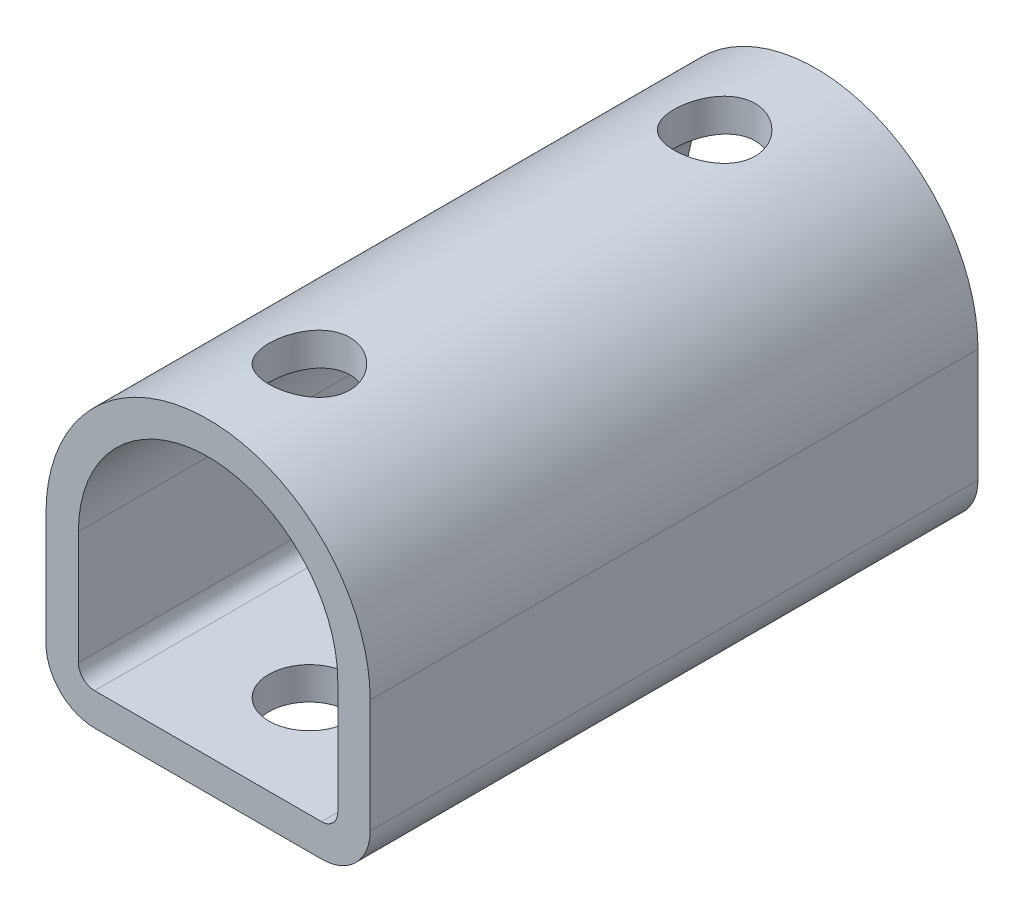
ISO-10303-21;
HEADER;
FILE_DESCRIPTION(('STEP AP214'),'2;1');
FILE_NAME('part.step','',(''),(''),'','','');
FILE_SCHEMA(('AUTOMOTIVE_DESIGN { 1 0 10303 214 1 1 1 1 }'));
ENDSEC;
DATA;
#1=APPLICATION_CONTEXT('core data for automotive mechanical design processes');
#2=APPLICATION_PROTOCOL_DEFINITION('international standard','automotive_design',2000,#1);
#3=PRODUCT_CONTEXT('',#1,'mechanical');
#4=PRODUCT('Part','Part','',(#3));
#5=PRODUCT_RELATED_PRODUCT_CATEGORY('part','',(#4));
#6=PRODUCT_DEFINITION_FORMATION('','',#4);
#7=PRODUCT_DEFINITION_CONTEXT('part definition',#1,'design');
#8=PRODUCT_DEFINITION('design','',#6,#7);
#9=PRODUCT_DEFINITION_SHAPE('','',#8);
#10=(LENGTH_UNIT() NAMED_UNIT(*) SI_UNIT(.MILLI.,.METRE.));
#11=(NAMED_UNIT(*) PLANE_ANGLE_UNIT() SI_UNIT($,.RADIAN.));
#12=(NAMED_UNIT(*) SI_UNIT($,.STERADIAN.) SOLID_ANGLE_UNIT());
#13=UNCERTAINTY_MEASURE_WITH_UNIT(LENGTH_MEASURE(1.E-05),#10,'distance_accuracy_value','');
#14=(GEOMETRIC_REPRESENTATION_CONTEXT(3) GLOBAL_UNCERTAINTY_ASSIGNED_CONTEXT((#13)) GLOBAL_UNIT_ASSIGNED_CONTEXT((#10,
#11,#12)) REPRESENTATION_CONTEXT('',''));
#15=CARTESIAN_POINT('',(0.,0.,0.));
#16=DIRECTION('',(0.,0.,1.));
#17=DIRECTION('',(1.,0.,0.));
#18=AXIS2_PLACEMENT_3D('',#15,#16,#17);
#19=CARTESIAN_POINT('',(14.,-14.,37.5));
#20=DIRECTION('',(0.,0.,1.));
#21=DIRECTION('',(1.,0.,0.));
#22=AXIS2_PLACEMENT_3D('',#19,#20,#21);
#23=PLANE('',#22);
#24=CARTESIAN_POINT('',(14.,-14.,37.5));
#25=DIRECTION('',(0.,0.,1.));
#26=DIRECTION('',(1.,0.,0.));
#27=AXIS2_PLACEMENT_3D('',#24,#25,#26);
#28=CIRCLE('',#27,6.);
#29=CARTESIAN_POINT('',(14.,-20.,37.5));
#30=VERTEX_POINT('',#29);
#31=CARTESIAN_POINT('',(20.,-14.,37.5));
#32=VERTEX_POINT('',#31);
#33=EDGE_CURVE('E181',#30,#32,#28,.T.);
#34=ORIENTED_EDGE('',*,*,#33,.T.);
#35=DIRECTION('',(0.,1.,0.));
#36=VECTOR('',#35,1.);
#37=CARTESIAN_POINT('',(20.,-14.,37.5));
#38=LINE('',#37,#36);
#39=CARTESIAN_POINT('',(20.,0.,37.5));
#40=VERTEX_POINT('',#39);
#41=EDGE_CURVE('E184',#32,#40,#38,.T.);
#42=ORIENTED_EDGE('',*,*,#41,.T.);
#43=CARTESIAN_POINT('',(0.,0.,37.5));
#44=DIRECTION('',(0.,0.,1.));
#45=DIRECTION('',(1.,0.,0.));
#46=AXIS2_PLACEMENT_3D('',#43,#44,#45);
#47=CIRCLE('',#46,20.);
#48=CARTESIAN_POINT('',(-20.,0.,37.5));
#49=VERTEX_POINT('',#48);
#50=EDGE_CURVE('E187',#40,#49,#47,.T.);
#51=ORIENTED_EDGE('',*,*,#50,.T.);
#52=DIRECTION('',(0.,-1.,0.));
#53=VECTOR('',#52,1.);
#54=CARTESIAN_POINT('',(-20.,0.,37.5));
#55=LINE('',#54,#53);
#56=CARTESIAN_POINT('',(-20.,-14.,37.5));
#57=VERTEX_POINT('',#56);
#58=EDGE_CURVE('E189',#49,#57,#55,.T.);
#59=ORIENTED_EDGE('',*,*,#58,.T.);
#60=CARTESIAN_POINT('',(-14.,-14.,37.5));
#61=DIRECTION('',(0.,0.,1.));
#62=DIRECTION('',(1.,0.,0.));
#63=AXIS2_PLACEMENT_3D('',#60,#61,#62);
#64=CIRCLE('',#63,6.);
#65=CARTESIAN_POINT('',(-14.,-20.,37.5));
#66=VERTEX_POINT('',#65);
#67=EDGE_CURVE('E191',#57,#66,#64,.T.);
#68=ORIENTED_EDGE('',*,*,#67,.T.);
#69=DIRECTION('',(1.,0.,0.));
#70=VECTOR('',#69,1.);
#71=CARTESIAN_POINT('',(-14.,-20.,37.5));
#72=LINE('',#71,#70);
#73=EDGE_CURVE('E193',#66,#30,#72,.T.);
#74=ORIENTED_EDGE('',*,*,#73,.T.);
#75=EDGE_LOOP('',(#34,#42,#51,#59,#68,#74));
#76=FACE_BOUND('',#75,.T.);
#77=DIRECTION('',(0.,-1.,0.));
#78=VECTOR('',#77,1.);
#79=CARTESIAN_POINT('',(-16.,0.,37.5));
#80=LINE('',#79,#78);
#81=CARTESIAN_POINT('',(-16.,0.,37.5));
#82=VERTEX_POINT('',#81);
#83=CARTESIAN_POINT('',(-16.,-14.,37.5));
#84=VERTEX_POINT('',#83);
#85=EDGE_CURVE('E136',#82,#84,#80,.T.);
#86=ORIENTED_EDGE('',*,*,#85,.F.);
#87=CARTESIAN_POINT('',(0.,0.,37.5));
#88=DIRECTION('',(0.,0.,1.));
#89=DIRECTION('',(1.,0.,0.));
#90=AXIS2_PLACEMENT_3D('',#87,#88,#89);
#91=CIRCLE('',#90,16.);
#92=CARTESIAN_POINT('',(16.,0.,37.5));
#93=VERTEX_POINT('',#92);
#94=EDGE_CURVE('E128',#93,#82,#91,.T.);
#95=ORIENTED_EDGE('',*,*,#94,.F.);
#96=DIRECTION('',(0.,1.,0.));
#97=VECTOR('',#96,1.);
#98=CARTESIAN_POINT('',(16.,-14.,37.5));
#99=LINE('',#98,#97);
#100=CARTESIAN_POINT('',(16.,-14.,37.5));
#101=VERTEX_POINT('',#100);
#102=EDGE_CURVE('E158',#101,#93,#99,.T.);
#103=ORIENTED_EDGE('',*,*,#102,.F.);
#104=CARTESIAN_POINT('',(14.,-14.,37.5));
#105=DIRECTION('',(0.,0.,1.));
#106=DIRECTION('',(1.,0.,0.));
#107=AXIS2_PLACEMENT_3D('',#104,#105,#106);
#108=CIRCLE('',#107,2.);
#109=CARTESIAN_POINT('',(14.,-16.,37.5));
#110=VERTEX_POINT('',#109);
#111=EDGE_CURVE('E156',#110,#101,#108,.T.);
#112=ORIENTED_EDGE('',*,*,#111,.F.);
#113=DIRECTION('',(1.,0.,0.));
#114=VECTOR('',#113,1.);
#115=CARTESIAN_POINT('',(-14.,-16.,37.5));
#116=LINE('',#115,#114);
#117=CARTESIAN_POINT('',(-14.,-16.,37.5));
#118=VERTEX_POINT('',#117);
#119=EDGE_CURVE('E151',#118,#110,#116,.T.);
#120=ORIENTED_EDGE('',*,*,#119,.F.);
#121=CARTESIAN_POINT('',(-14.,-14.,37.5));
#122=DIRECTION('',(0.,0.,1.));
#123=DIRECTION('',(1.,0.,0.));
#124=AXIS2_PLACEMENT_3D('',#121,#122,#123);
#125=CIRCLE('',#124,2.);
#126=EDGE_CURVE('E149',#84,#118,#125,.T.);
#127=ORIENTED_EDGE('',*,*,#126,.F.);
#128=EDGE_LOOP('',(#86,#95,#103,#112,#120,#127));
#129=FACE_BOUND('',#128,.T.);
#130=ADVANCED_FACE('F32',(#76,#129),#23,.T.);
#131=CARTESIAN_POINT('',(14.,-14.,-37.5));
#132=DIRECTION('',(0.,0.,1.));
#133=DIRECTION('',(1.,0.,0.));
#134=AXIS2_PLACEMENT_3D('',#131,#132,#133);
#135=PLANE('',#134);
#136=CARTESIAN_POINT('',(14.,-14.,-37.5));
#137=DIRECTION('',(0.,0.,1.));
#138=DIRECTION('',(1.,0.,0.));
#139=AXIS2_PLACEMENT_3D('',#136,#137,#138);
#140=CIRCLE('',#139,6.);
#141=CARTESIAN_POINT('',(14.,-20.,-37.5));
#142=VERTEX_POINT('',#141);
#143=CARTESIAN_POINT('',(20.,-14.,-37.5));
#144=VERTEX_POINT('',#143);
#145=EDGE_CURVE('E144',#142,#144,#140,.T.);
#146=ORIENTED_EDGE('',*,*,#145,.F.);
#147=DIRECTION('',(1.,0.,0.));
#148=VECTOR('',#147,1.);
#149=CARTESIAN_POINT('',(-14.,-20.,-37.5));
#150=LINE('',#149,#148);
#151=CARTESIAN_POINT('',(-14.,-20.,-37.5));
#152=VERTEX_POINT('',#151);
#153=EDGE_CURVE('E185',#152,#142,#150,.T.);
#154=ORIENTED_EDGE('',*,*,#153,.F.);
#155=CARTESIAN_POINT('',(-14.,-14.,-37.5));
#156=DIRECTION('',(0.,0.,1.));
#157=DIRECTION('',(1.,0.,0.));
#158=AXIS2_PLACEMENT_3D('',#155,#156,#157);
#159=CIRCLE('',#158,6.);
#160=CARTESIAN_POINT('',(-20.,-14.,-37.5));
#161=VERTEX_POINT('',#160);
#162=EDGE_CURVE('E204',#161,#152,#159,.T.);
#163=ORIENTED_EDGE('',*,*,#162,.F.);
#164=DIRECTION('',(0.,-1.,0.));
#165=VECTOR('',#164,1.);
#166=CARTESIAN_POINT('',(-20.,0.,-37.5));
#167=LINE('',#166,#165);
#168=CARTESIAN_POINT('',(-20.,0.,-37.5));
#169=VERTEX_POINT('',#168);
#170=EDGE_CURVE('E202',#169,#161,#167,.T.);
#171=ORIENTED_EDGE('',*,*,#170,.F.);
#172=CARTESIAN_POINT('',(0.,0.,-37.5));
#173=DIRECTION('',(0.,0.,1.));
#174=DIRECTION('',(1.,0.,0.));
#175=AXIS2_PLACEMENT_3D('',#172,#173,#174);
#176=CIRCLE('',#175,20.);
#177=CARTESIAN_POINT('',(20.,0.,-37.5));
#178=VERTEX_POINT('',#177);
#179=EDGE_CURVE('E200',#178,#169,#176,.T.);
#180=ORIENTED_EDGE('',*,*,#179,.F.);
#181=DIRECTION('',(0.,1.,0.));
#182=VECTOR('',#181,1.);
#183=CARTESIAN_POINT('',(20.,-14.,-37.5));
#184=LINE('',#183,#182);
#185=EDGE_CURVE('E198',#144,#178,#184,.T.);
#186=ORIENTED_EDGE('',*,*,#185,.F.);
#187=EDGE_LOOP('',(#146,#154,#163,#171,#180,#186));
#188=FACE_BOUND('',#187,.T.);
#189=CARTESIAN_POINT('',(0.,0.,-37.5));
#190=DIRECTION('',(0.,0.,1.));
#191=DIRECTION('',(1.,0.,0.));
#192=AXIS2_PLACEMENT_3D('',#189,#190,#191);
#193=CIRCLE('',#192,16.);
#194=CARTESIAN_POINT('',(16.,0.,-37.5));
#195=VERTEX_POINT('',#194);
#196=CARTESIAN_POINT('',(-16.,0.,-37.5));
#197=VERTEX_POINT('',#196);
#198=EDGE_CURVE('E62',#195,#197,#193,.T.);
#199=ORIENTED_EDGE('',*,*,#198,.T.);
#200=DIRECTION('',(0.,-1.,0.));
#201=VECTOR('',#200,1.);
#202=CARTESIAN_POINT('',(-16.,0.,-37.5));
#203=LINE('',#202,#201);
#204=CARTESIAN_POINT('',(-16.,-14.,-37.5));
#205=VERTEX_POINT('',#204);
#206=EDGE_CURVE('E143',#197,#205,#203,.T.);
#207=ORIENTED_EDGE('',*,*,#206,.T.);
#208=CARTESIAN_POINT('',(-14.,-14.,-37.5));
#209=DIRECTION('',(0.,0.,1.));
#210=DIRECTION('',(1.,0.,0.));
#211=AXIS2_PLACEMENT_3D('',#208,#209,#210);
#212=CIRCLE('',#211,2.);
#213=CARTESIAN_POINT('',(-14.,-16.,-37.5));
#214=VERTEX_POINT('',#213);
#215=EDGE_CURVE('E163',#205,#214,#212,.T.);
#216=ORIENTED_EDGE('',*,*,#215,.T.);
#217=DIRECTION('',(1.,0.,0.));
#218=VECTOR('',#217,1.);
#219=CARTESIAN_POINT('',(-14.,-16.,-37.5));
#220=LINE('',#219,#218);
#221=CARTESIAN_POINT('',(14.,-16.,-37.5));
#222=VERTEX_POINT('',#221);
#223=EDGE_CURVE('E166',#214,#222,#220,.T.);
#224=ORIENTED_EDGE('',*,*,#223,.T.);
#225=CARTESIAN_POINT('',(14.,-14.,-37.5));
#226=DIRECTION('',(0.,0.,1.));
#227=DIRECTION('',(1.,0.,0.));
#228=AXIS2_PLACEMENT_3D('',#225,#226,#227);
#229=CIRCLE('',#228,2.);
#230=CARTESIAN_POINT('',(16.,-14.,-37.5));
#231=VERTEX_POINT('',#230);
#232=EDGE_CURVE('E169',#222,#231,#229,.T.);
#233=ORIENTED_EDGE('',*,*,#232,.T.);
#234=DIRECTION('',(0.,1.,0.));
#235=VECTOR('',#234,1.);
#236=CARTESIAN_POINT('',(16.,-14.,-37.5));
#237=LINE('',#236,#235);
#238=EDGE_CURVE('E137',#231,#195,#237,.T.);
#239=ORIENTED_EDGE('',*,*,#238,.T.);
#240=EDGE_LOOP('',(#199,#207,#216,#224,#233,#239));
#241=FACE_BOUND('',#240,.T.);
#242=ADVANCED_FACE('F282',(#188,#241),#135,.F.);
#243=CARTESIAN_POINT('',(14.,-14.,37.5));
#244=DIRECTION('',(0.,0.,-1.));
#245=DIRECTION('',(-1.,0.,0.));
#246=AXIS2_PLACEMENT_3D('',#243,#244,#245);
#247=CYLINDRICAL_SURFACE('',#246,6.);
#248=ORIENTED_EDGE('',*,*,#145,.T.);
#249=DIRECTION('',(0.,0.,-1.));
#250=VECTOR('',#249,1.);
#251=CARTESIAN_POINT('',(20.,-14.,37.5));
#252=LINE('',#251,#250);
#253=EDGE_CURVE('E11',#32,#144,#252,.T.);
#254=ORIENTED_EDGE('',*,*,#253,.F.);
#255=ORIENTED_EDGE('',*,*,#33,.F.);
#256=DIRECTION('',(0.,0.,-1.));
#257=VECTOR('',#256,1.);
#258=CARTESIAN_POINT('',(14.,-20.,37.5));
#259=LINE('',#258,#257);
#260=EDGE_CURVE('E195',#30,#142,#259,.T.);
#261=ORIENTED_EDGE('',*,*,#260,.T.);
#262=EDGE_LOOP('',(#248,#254,#255,#261));
#263=FACE_BOUND('',#262,.T.);
#264=ADVANCED_FACE('F34',(#263),#247,.T.);
#265=CARTESIAN_POINT('',(20.,-14.,37.5));
#266=DIRECTION('',(-1.,0.,0.));
#267=DIRECTION('',(0.,0.,1.));
#268=AXIS2_PLACEMENT_3D('',#265,#266,#267);
#269=PLANE('',#268);
#270=ORIENTED_EDGE('',*,*,#185,.T.);
#271=DIRECTION('',(0.,0.,-1.));
#272=VECTOR('',#271,1.);
#273=CARTESIAN_POINT('',(20.,0.,37.5));
#274=LINE('',#273,#272);
#275=EDGE_CURVE('E46',#40,#178,#274,.T.);
#276=ORIENTED_EDGE('',*,*,#275,.F.);
#277=ORIENTED_EDGE('',*,*,#41,.F.);
#278=ORIENTED_EDGE('',*,*,#253,.T.);
#279=EDGE_LOOP('',(#270,#276,#277,#278));
#280=FACE_BOUND('',#279,.T.);
#281=ADVANCED_FACE('F299',(#280),#269,.F.);
#282=CARTESIAN_POINT('',(0.,0.,37.5));
#283=DIRECTION('',(0.,0.,-1.));
#284=DIRECTION('',(-1.,0.,0.));
#285=AXIS2_PLACEMENT_3D('',#282,#283,#284);
#286=CYLINDRICAL_SURFACE('',#285,20.);
#287=CARTESIAN_POINT('',(0.,20.,20.));
#288=CARTESIAN_POINT('',(0.276253628899106,19.9999953289337,20.0000077524605));
#289=CARTESIAN_POINT('',(0.552593859435879,19.9942192710609,20.0229718359126));
#290=CARTESIAN_POINT('',(1.09735441256844,19.9717371276631,20.11408383769));
#291=CARTESIAN_POINT('',(1.3657701562358,19.9550248473325,20.1822573651262));
#292=CARTESIAN_POINT('',(1.88673624060859,19.9125208777344,20.361464178207));
#293=CARTESIAN_POINT('',(2.13930521143334,19.8867400947353,20.4724459957176));
#294=CARTESIAN_POINT('',(2.62224043968142,19.8288447935874,20.7339379668161));
#295=CARTESIAN_POINT('',(2.85260594782921,19.7967300618052,20.8844494537299));
#296=CARTESIAN_POINT('',(3.28933975766972,19.7289137863898,21.2240026321806));
#297=CARTESIAN_POINT('',(3.49518563353685,19.6931569049375,21.4137052498635));
#298=CARTESIAN_POINT('',(3.87249642401106,19.6224540039312,21.8248406830301));
#299=CARTESIAN_POINT('',(4.0439574564973,19.5875080763289,22.0462770764898));
#300=CARTESIAN_POINT('',(4.35008847599658,19.5218258566056,22.51865075579));
#301=CARTESIAN_POINT('',(4.48417405308379,19.4911598154937,22.7699774360291));
#302=CARTESIAN_POINT('',(4.70798969516914,19.4383164939339,23.2924947055334));
#303=CARTESIAN_POINT('',(4.79772685146713,19.4161378564806,23.5636821111067));
#304=CARTESIAN_POINT('',(4.92851612268254,19.3833492232108,24.1124783273389));
#305=CARTESIAN_POINT('',(4.97050756110684,19.372516366567,24.38984965346));
#306=CARTESIAN_POINT('',(5.00753925022136,19.3629787486531,24.9478952299978));
#307=CARTESIAN_POINT('',(5.0025871393937,19.3642720142643,25.2285689356405));
#308=CARTESIAN_POINT('',(4.94662174879901,19.3786401838939,25.7780526924845));
#309=CARTESIAN_POINT('',(4.89672780063544,19.3914287669098,26.0469854048844));
#310=CARTESIAN_POINT('',(4.75408062300997,19.426890322369,26.5725368363702));
#311=CARTESIAN_POINT('',(4.6613243402313,19.4495639989746,26.8291546767631));
#312=CARTESIAN_POINT('',(4.43463159312395,19.5025037968553,27.3257933875071));
#313=CARTESIAN_POINT('',(4.30028889077639,19.5328442489939,27.5656205726319));
#314=CARTESIAN_POINT('',(3.99452092004982,19.5976570281997,28.0197290325227));
#315=CARTESIAN_POINT('',(3.82308916269612,19.6321300778209,28.2340058268908));
#316=CARTESIAN_POINT('',(3.44221141560407,19.7025293513297,28.637345385648));
#317=CARTESIAN_POINT('',(3.23182086055287,19.7384689826,28.8255149668712));
#318=CARTESIAN_POINT('',(2.78203972501233,19.8068655192919,29.164070808213));
#319=CARTESIAN_POINT('',(2.54264825902648,19.8393223183136,29.3144559142119));
#320=CARTESIAN_POINT('',(2.04038629560464,19.897257736473,29.5735019540813));
#321=CARTESIAN_POINT('',(1.77743797736208,19.9227120042576,29.6820178008481));
#322=CARTESIAN_POINT('',(1.23625336047628,19.9635972330472,29.8530576856986));
#323=CARTESIAN_POINT('',(0.958019997168284,19.9790301113094,29.9155905213938));
#324=CARTESIAN_POINT('',(0.401799901300091,19.9978499757125,29.9915252185295));
#325=CARTESIAN_POINT('',(0.123989066627368,20.0015351169426,30.006143420251));
#326=CARTESIAN_POINT('',(-0.430109582671693,19.9972934938151,29.9891699931484));
#327=CARTESIAN_POINT('',(-0.706397532148651,19.9893677747284,29.9575825240029));
#328=CARTESIAN_POINT('',(-1.24538089592163,19.9629860375784,29.8500969720287));
#329=CARTESIAN_POINT('',(-1.50821706322916,19.9446878061929,29.7748624550767));
#330=CARTESIAN_POINT('',(-2.01752430817505,19.899623554472,29.5829763865718));
#331=CARTESIAN_POINT('',(-2.26399373010883,19.8728566789995,29.4663206522893));
#332=CARTESIAN_POINT('',(-2.73841044809943,19.8131102642072,29.1925462370844));
#333=CARTESIAN_POINT('',(-2.96595147278588,19.7800289122193,29.0347462920114));
#334=CARTESIAN_POINT('',(-3.39175537881103,19.7114836395924,28.6840336373428));
#335=CARTESIAN_POINT('',(-3.5900131965775,19.676019308434,28.4911148679412));
#336=CARTESIAN_POINT('',(-3.95663522690826,19.6056318986475,28.0699934638543));
#337=CARTESIAN_POINT('',(-4.12414622540361,19.57074347274,27.8410409900013));
#338=CARTESIAN_POINT('',(-4.41836919671214,19.5064292794107,27.3575578851049));
#339=CARTESIAN_POINT('',(-4.54508298053822,19.4770032695336,27.1030283900992));
#340=CARTESIAN_POINT('',(-4.75317140202425,19.4272698238587,26.5769809253119));
#341=CARTESIAN_POINT('',(-4.83481465547783,19.4069085073875,26.3055745722898));
#342=CARTESIAN_POINT('',(-4.95115219981055,19.3775581342603,25.7523012071515));
#343=CARTESIAN_POINT('',(-4.98585675825594,19.3685665905607,25.4704364966046));
#344=CARTESIAN_POINT('',(-5.00679530111926,19.3631633735661,24.9129299204403));
#345=CARTESIAN_POINT('',(-4.99439299259114,19.366397756045,24.6373418828543));
#346=CARTESIAN_POINT('',(-4.92459092769652,19.3842636317314,24.092320371061));
#347=CARTESIAN_POINT('',(-4.86719207562105,19.3988948958968,23.8228867732805));
#348=CARTESIAN_POINT('',(-4.70977106481401,19.4377086899188,23.2993051364666));
#349=CARTESIAN_POINT('',(-4.61000468226917,19.461833841343,23.0450756492041));
#350=CARTESIAN_POINT('',(-4.37088304534896,19.5169251906949,22.5567820576162));
#351=CARTESIAN_POINT('',(-4.2315223001136,19.5478923373231,22.3227207560423));
#352=CARTESIAN_POINT('',(-3.91289249545746,19.6141878088207,21.8748179033279));
#353=CARTESIAN_POINT('',(-3.73267720970759,19.6496088277351,21.6616630885872));
#354=CARTESIAN_POINT('',(-3.33929790396568,19.7202675748663,21.2681765173483));
#355=CARTESIAN_POINT('',(-3.12612607087045,19.755505257566,21.08785256629));
#356=CARTESIAN_POINT('',(-2.66822528900865,19.8225885215915,20.7619623047848));
#357=CARTESIAN_POINT('',(-2.42299474105462,19.8543611121963,20.6170846210948));
#358=CARTESIAN_POINT('',(-1.9108868650349,19.9101641658366,20.3708417901982));
#359=CARTESIAN_POINT('',(-1.64402521145579,19.9342001733259,20.2694454645049));
#360=CARTESIAN_POINT('',(-1.14803417747823,19.9682686521849,20.1280938989012));
#361=CARTESIAN_POINT('',(-0.921267236360222,19.9800861684231,20.0801625231552));
#362=CARTESIAN_POINT('',(-0.463020238454272,19.9959535077316,20.0161135212602));
#363=CARTESIAN_POINT('',(-0.231540537475383,20.0000039150298,19.9999935023157));
#364=CARTESIAN_POINT('',(0.,20.,20.));
#365=B_SPLINE_CURVE_WITH_KNOTS('',3,(#287,#288,#289,#290,#291,#292,#293,#294,#295,#296,#297,
#298,#299,#300,#301,#302,#303,#304,#305,#306,#307,#308,#309,#310,#311,#312,#313,#314,#315,#316,
#317,#318,#319,#320,#321,#322,#323,#324,#325,#326,#327,#328,#329,#330,#331,#332,#333,#334,#335,
#336,#337,#338,#339,#340,#341,#342,#343,#344,#345,#346,#347,#348,#349,#350,#351,#352,#353,#354,
#355,#356,#357,#358,#359,#360,#361,#362,#363,#364),.UNSPECIFIED.,.T.,.F.,(4,2,2,2,2,2,2,2,2,2,2,
2,2,2,2,2,2,2,2,2,2,2,2,2,2,2,2,2,2,2,2,2,2,2,2,2,2,2,4),(0.,0.827912374906297,1.65629412587966,
2.48368300762035,3.31109980056442,4.15381451457129,4.99662431933539,5.85195491819355,
6.7071487056456,7.54520983670232,8.38313460386724,9.20074990034461,10.0184234489786,
10.84435092924,11.6704230279828,12.5200500324113,13.3697029853856,14.2222743004145,
15.0746824563988,15.9052769650865,16.7357967038688,17.5540091505786,18.372304244187,
19.2051195856224,20.0380787670446,20.8914836402599,21.7448506250943,22.5930751539527,
23.4411141086095,24.2647926801851,25.0884546987995,25.9072133522466,26.7260856048284,
27.5663192139287,28.4067523259456,29.2624061835846,30.1174454609767,30.8114080983367,
31.505318535033),.UNSPECIFIED.);
#366=CARTESIAN_POINT('',(0.,20.,20.));
#367=VERTEX_POINT('',#366);
#368=EDGE_CURVE('E228',#367,#367,#365,.T.);
#369=ORIENTED_EDGE('',*,*,#368,.T.);
#370=EDGE_LOOP('',(#369));
#371=FACE_BOUND('',#370,.T.);
#372=CARTESIAN_POINT('',(0.,20.,-30.));
#373=CARTESIAN_POINT('',(0.276253628899103,19.9999953289337,-29.9999922475395));
#374=CARTESIAN_POINT('',(0.552593859435876,19.9942192710609,-29.9770281640874));
#375=CARTESIAN_POINT('',(1.09735441256844,19.9717371276631,-29.88591616231));
#376=CARTESIAN_POINT('',(1.3657701562358,19.9550248473325,-29.8177426348738));
#377=CARTESIAN_POINT('',(1.88673624060859,19.9125208777344,-29.638535821793));
#378=CARTESIAN_POINT('',(2.13930521143334,19.8867400947353,-29.5275540042824));
#379=CARTESIAN_POINT('',(2.62224043968142,19.8288447935874,-29.2660620331839));
#380=CARTESIAN_POINT('',(2.85260594782921,19.7967300618052,-29.1155505462701));
#381=CARTESIAN_POINT('',(3.28933975766971,19.7289137863898,-28.7759973678194));
#382=CARTESIAN_POINT('',(3.49518563353685,19.6931569049375,-28.5862947501365));
#383=CARTESIAN_POINT('',(3.87249642401106,19.6224540039312,-28.1751593169699));
#384=CARTESIAN_POINT('',(4.0439574564973,19.5875080763289,-27.9537229235102));
#385=CARTESIAN_POINT('',(4.35008847599657,19.5218258566056,-27.48134924421));
#386=CARTESIAN_POINT('',(4.48417405308379,19.4911598154937,-27.2300225639709));
#387=CARTESIAN_POINT('',(4.70798969516914,19.4383164939339,-26.7075052944665));
#388=CARTESIAN_POINT('',(4.79772685146713,19.4161378564806,-26.4363178888933));
#389=CARTESIAN_POINT('',(4.92851612268254,19.3833492232108,-25.8875216726611));
#390=CARTESIAN_POINT('',(4.97050756110684,19.372516366567,-25.61015034654));
#391=CARTESIAN_POINT('',(5.00753925022135,19.362978748653,-25.0521047700022));
#392=CARTESIAN_POINT('',(5.00258713939369,19.3642720142643,-24.7714310643595));
#393=CARTESIAN_POINT('',(4.94662174879901,19.3786401838939,-24.2219473075155));
#394=CARTESIAN_POINT('',(4.89672780063544,19.3914287669098,-23.9530145951156));
#395=CARTESIAN_POINT('',(4.75408062300997,19.426890322369,-23.4274631636298));
#396=CARTESIAN_POINT('',(4.6613243402313,19.4495639989746,-23.1708453232369));
#397=CARTESIAN_POINT('',(4.43463159312394,19.5025037968553,-22.6742066124929));
#398=CARTESIAN_POINT('',(4.30028889077639,19.5328442489939,-22.4343794273681));
#399=CARTESIAN_POINT('',(3.99452092004981,19.5976570281997,-21.9802709674773));
#400=CARTESIAN_POINT('',(3.82308916269612,19.6321300778209,-21.7659941731092));
#401=CARTESIAN_POINT('',(3.44221141560406,19.7025293513297,-21.362654614352));
#402=CARTESIAN_POINT('',(3.23182086055286,19.7384689826,-21.1744850331288));
#403=CARTESIAN_POINT('',(2.78203972501233,19.8068655192919,-20.835929191787));
#404=CARTESIAN_POINT('',(2.54264825902647,19.8393223183136,-20.6855440857881));
#405=CARTESIAN_POINT('',(2.04038629560463,19.897257736473,-20.4264980459187));
#406=CARTESIAN_POINT('',(1.77743797736207,19.9227120042576,-20.3179821991519));
#407=CARTESIAN_POINT('',(1.23625336047627,19.9635972330472,-20.1469423143014));
#408=CARTESIAN_POINT('',(0.95801999716828,19.9790301113094,-20.0844094786062));
#409=CARTESIAN_POINT('',(0.401799901300088,19.9978499757125,-20.0084747814706));
#410=CARTESIAN_POINT('',(0.123989066627365,20.0015351169426,-19.993856579749));
#411=CARTESIAN_POINT('',(-0.430109582671695,19.9972934938151,-20.0108300068516));
#412=CARTESIAN_POINT('',(-0.706397532148654,19.9893677747284,-20.0424174759971));
#413=CARTESIAN_POINT('',(-1.24538089592163,19.9629860375783,-20.1499030279713));
#414=CARTESIAN_POINT('',(-1.50821706322916,19.9446878061929,-20.2251375449233));
#415=CARTESIAN_POINT('',(-2.01752430817505,19.899623554472,-20.4170236134282));
#416=CARTESIAN_POINT('',(-2.26399373010884,19.8728566789995,-20.5336793477107));
#417=CARTESIAN_POINT('',(-2.73841044809943,19.8131102642072,-20.8074537629156));
#418=CARTESIAN_POINT('',(-2.96595147278588,19.7800289122193,-20.9652537079886));
#419=CARTESIAN_POINT('',(-3.39175537881103,19.7114836395924,-21.3159663626572));
#420=CARTESIAN_POINT('',(-3.5900131965775,19.676019308434,-21.5088851320588));
#421=CARTESIAN_POINT('',(-3.95663522690826,19.6056318986475,-21.9300065361457));
#422=CARTESIAN_POINT('',(-4.12414622540361,19.57074347274,-22.1589590099987));
#423=CARTESIAN_POINT('',(-4.41836919671214,19.5064292794107,-22.6424421148951));
#424=CARTESIAN_POINT('',(-4.54508298053822,19.4770032695336,-22.8969716099008));
#425=CARTESIAN_POINT('',(-4.75317140202425,19.4272698238587,-23.4230190746881));
#426=CARTESIAN_POINT('',(-4.83481465547783,19.4069085073875,-23.6944254277102));
#427=CARTESIAN_POINT('',(-4.95115219981056,19.3775581342603,-24.2476987928485));
#428=CARTESIAN_POINT('',(-4.98585675825594,19.3685665905607,-24.5295635033954));
#429=CARTESIAN_POINT('',(-5.00679530111927,19.3631633735661,-25.0870700795597));
#430=CARTESIAN_POINT('',(-4.99439299259114,19.366397756045,-25.3626581171457));
#431=CARTESIAN_POINT('',(-4.92459092769653,19.3842636317314,-25.907679628939));
#432=CARTESIAN_POINT('',(-4.86719207562105,19.3988948958968,-26.1771132267195));
#433=CARTESIAN_POINT('',(-4.70977106481401,19.4377086899188,-26.7006948635334));
#434=CARTESIAN_POINT('',(-4.61000468226917,19.461833841343,-26.9549243507959));
#435=CARTESIAN_POINT('',(-4.37088304534896,19.5169251906949,-27.4432179423838));
#436=CARTESIAN_POINT('',(-4.23152230011361,19.5478923373231,-27.6772792439577));
#437=CARTESIAN_POINT('',(-3.91289249545746,19.6141878088207,-28.1251820966721));
#438=CARTESIAN_POINT('',(-3.7326772097076,19.6496088277351,-28.3383369114128));
#439=CARTESIAN_POINT('',(-3.33929790396568,19.7202675748663,-28.7318234826517));
#440=CARTESIAN_POINT('',(-3.12612607087045,19.755505257566,-28.91214743371));
#441=CARTESIAN_POINT('',(-2.66822528900865,19.8225885215915,-29.2380376952153));
#442=CARTESIAN_POINT('',(-2.42299474105462,19.8543611121963,-29.3829153789052));
#443=CARTESIAN_POINT('',(-1.9108868650349,19.9101641658366,-29.6291582098018));
#444=CARTESIAN_POINT('',(-1.64402521145579,19.9342001733259,-29.7305545354951));
#445=CARTESIAN_POINT('',(-1.14803417747824,19.9682686521849,-29.8719061010988));
#446=CARTESIAN_POINT('',(-0.921267236360227,19.9800861684231,-29.9198374768448));
#447=CARTESIAN_POINT('',(-0.463020238454276,19.9959535077316,-29.9838864787398));
#448=CARTESIAN_POINT('',(-0.231540537475387,20.0000039150298,-30.0000064976843));
#449=CARTESIAN_POINT('',(0.,20.,-30.));
#450=B_SPLINE_CURVE_WITH_KNOTS('',3,(#372,#373,#374,#375,#376,#377,#378,#379,#380,#381,#382,
#383,#384,#385,#386,#387,#388,#389,#390,#391,#392,#393,#394,#395,#396,#397,#398,#399,#400,#401,
#402,#403,#404,#405,#406,#407,#408,#409,#410,#411,#412,#413,#414,#415,#416,#417,#418,#419,#420,
#421,#422,#423,#424,#425,#426,#427,#428,#429,#430,#431,#432,#433,#434,#435,#436,#437,#438,#439,
#440,#441,#442,#443,#444,#445,#446,#447,#448,#449),.UNSPECIFIED.,.T.,.F.,(4,2,2,2,2,2,2,2,2,2,2,
2,2,2,2,2,2,2,2,2,2,2,2,2,2,2,2,2,2,2,2,2,2,2,2,2,2,2,4),(0.,0.827912374906298,1.65629412587966,
2.48368300762035,3.31109980056442,4.15381451457129,4.99662431933539,5.85195491819355,
6.7071487056456,7.54520983670232,8.38313460386724,9.20074990034461,10.0184234489786,
10.84435092924,11.6704230279828,12.5200500324113,13.3697029853856,14.2222743004145,
15.0746824563988,15.9052769650865,16.7357967038688,17.5540091505786,18.372304244187,
19.2051195856224,20.0380787670446,20.8914836402599,21.7448506250943,22.5930751539527,
23.4411141086095,24.2647926801851,25.0884546987995,25.9072133522466,26.7260856048284,
27.5663192139287,28.4067523259456,29.2624061835846,30.1174454609767,30.8114080983366,
31.505318535033),.UNSPECIFIED.);
#451=CARTESIAN_POINT('',(0.,20.,-30.));
#452=VERTEX_POINT('',#451);
#453=EDGE_CURVE('E221',#452,#452,#450,.T.);
#454=ORIENTED_EDGE('',*,*,#453,.T.);
#455=EDGE_LOOP('',(#454));
#456=FACE_BOUND('',#455,.T.);
#457=ORIENTED_EDGE('',*,*,#179,.T.);
#458=DIRECTION('',(0.,0.,-1.));
#459=VECTOR('',#458,1.);
#460=CARTESIAN_POINT('',(-20.,0.,37.5));
#461=LINE('',#460,#459);
#462=EDGE_CURVE('E215',#49,#169,#461,.T.);
#463=ORIENTED_EDGE('',*,*,#462,.F.);
#464=ORIENTED_EDGE('',*,*,#50,.F.);
#465=ORIENTED_EDGE('',*,*,#275,.T.);
#466=EDGE_LOOP('',(#457,#463,#464,#465));
#467=FACE_BOUND('',#466,.T.);
#468=ADVANCED_FACE('F247',(#371,#456,#467),#286,.T.);
#469=CARTESIAN_POINT('',(-20.,0.,37.5));
#470=DIRECTION('',(1.,0.,0.));
#471=DIRECTION('',(0.,0.,-1.));
#472=AXIS2_PLACEMENT_3D('',#469,#470,#471);
#473=PLANE('',#472);
#474=ORIENTED_EDGE('',*,*,#170,.T.);
#475=DIRECTION('',(0.,0.,-1.));
#476=VECTOR('',#475,1.);
#477=CARTESIAN_POINT('',(-20.,-14.,37.5));
#478=LINE('',#477,#476);
#479=EDGE_CURVE('E212',#57,#161,#478,.T.);
#480=ORIENTED_EDGE('',*,*,#479,.F.);
#481=ORIENTED_EDGE('',*,*,#58,.F.);
#482=ORIENTED_EDGE('',*,*,#462,.T.);
#483=EDGE_LOOP('',(#474,#480,#481,#482));
#484=FACE_BOUND('',#483,.T.);
#485=ADVANCED_FACE('F292',(#484),#473,.F.);
#486=CARTESIAN_POINT('',(-14.,-14.,37.5));
#487=DIRECTION('',(0.,0.,-1.));
#488=DIRECTION('',(-1.,0.,0.));
#489=AXIS2_PLACEMENT_3D('',#486,#487,#488);
#490=CYLINDRICAL_SURFACE('',#489,6.);
#491=ORIENTED_EDGE('',*,*,#162,.T.);
#492=DIRECTION('',(0.,0.,-1.));
#493=VECTOR('',#492,1.);
#494=CARTESIAN_POINT('',(-14.,-20.,37.5));
#495=LINE('',#494,#493);
#496=EDGE_CURVE('E209',#66,#152,#495,.T.);
#497=ORIENTED_EDGE('',*,*,#496,.F.);
#498=ORIENTED_EDGE('',*,*,#67,.F.);
#499=ORIENTED_EDGE('',*,*,#479,.T.);
#500=EDGE_LOOP('',(#491,#497,#498,#499));
#501=FACE_BOUND('',#500,.T.);
#502=ADVANCED_FACE('F289',(#501),#490,.T.);
#503=CARTESIAN_POINT('',(-14.,-20.,37.5));
#504=DIRECTION('',(0.,1.,0.));
#505=DIRECTION('',(0.,0.,1.));
#506=AXIS2_PLACEMENT_3D('',#503,#504,#505);
#507=PLANE('',#506);
#508=CARTESIAN_POINT('',(0.,-20.,25.));
#509=DIRECTION('',(0.,-1.,0.));
#510=DIRECTION('',(0.,0.,-1.));
#511=AXIS2_PLACEMENT_3D('',#508,#509,#510);
#512=CIRCLE('',#511,4.99999999999999);
#513=CARTESIAN_POINT('',(0.,-20.,20.));
#514=VERTEX_POINT('',#513);
#515=EDGE_CURVE('E441',#514,#514,#512,.T.);
#516=ORIENTED_EDGE('',*,*,#515,.F.);
#517=EDGE_LOOP('',(#516));
#518=FACE_BOUND('',#517,.T.);
#519=CARTESIAN_POINT('',(0.,-20.,-25.));
#520=DIRECTION('',(0.,-1.,0.));
#521=DIRECTION('',(0.,0.,-1.));
#522=AXIS2_PLACEMENT_3D('',#519,#520,#521);
#523=CIRCLE('',#522,4.99999999999999);
#524=CARTESIAN_POINT('',(0.,-20.,-30.));
#525=VERTEX_POINT('',#524);
#526=EDGE_CURVE('E222',#525,#525,#523,.T.);
#527=ORIENTED_EDGE('',*,*,#526,.F.);
#528=EDGE_LOOP('',(#527));
#529=FACE_BOUND('',#528,.T.);
#530=ORIENTED_EDGE('',*,*,#153,.T.);
#531=ORIENTED_EDGE('',*,*,#260,.F.);
#532=ORIENTED_EDGE('',*,*,#73,.F.);
#533=ORIENTED_EDGE('',*,*,#496,.T.);
#534=EDGE_LOOP('',(#530,#531,#532,#533));
#535=FACE_BOUND('',#534,.T.);
#536=ADVANCED_FACE('F277',(#518,#529,#535),#507,.F.);
#537=CARTESIAN_POINT('',(0.,0.,37.5));
#538=DIRECTION('',(0.,0.,-1.));
#539=DIRECTION('',(-1.,0.,0.));
#540=AXIS2_PLACEMENT_3D('',#537,#538,#539);
#541=CYLINDRICAL_SURFACE('',#540,16.);
#542=CARTESIAN_POINT('',(0.,16.,20.));
#543=CARTESIAN_POINT('',(0.273756740698182,15.9999986351195,20.0000017863503));
#544=CARTESIAN_POINT('',(0.547532210011412,15.9929077993933,20.0225569077778));
#545=CARTESIAN_POINT('',(1.08707683835382,15.9653157635526,20.111944966157));
#546=CARTESIAN_POINT('',(1.35284417090373,15.9448115279957,20.1787879254576));
#547=CARTESIAN_POINT('',(1.86851417460313,15.892632627915,20.3542774847828));
#548=CARTESIAN_POINT('',(2.11844070794284,15.860975259956,20.4628593786114));
#549=CARTESIAN_POINT('',(2.59653920938621,15.7897587664487,20.7184692707138));
#550=CARTESIAN_POINT('',(2.82470774178094,15.7501983960149,20.8655033271243));
#551=CARTESIAN_POINT('',(3.25986133980768,15.6660085495921,21.1986239680674));
#552=CARTESIAN_POINT('',(3.46608011262119,15.621268637007,21.3856835402367));
#553=CARTESIAN_POINT('',(3.84478952815342,15.5324018550409,21.7914735696618));
#554=CARTESIAN_POINT('',(4.01727389161514,15.4882751012093,22.0102099100066));
#555=CARTESIAN_POINT('',(4.32777345930637,15.4044457876484,22.4797782552073));
#556=CARTESIAN_POINT('',(4.46483136593109,15.3648795310221,22.7312699100077));
#557=CARTESIAN_POINT('',(4.69438964299238,15.2963120709366,23.2551692598226));
#558=CARTESIAN_POINT('',(4.78690175085853,15.2673080849026,23.5275714231434));
#559=CARTESIAN_POINT('',(4.92193839721856,15.224304279618,24.0769123098337));
#560=CARTESIAN_POINT('',(4.96588440031618,15.2098789171452,24.3534673745682));
#561=CARTESIAN_POINT('',(5.00698220147793,15.1964022056731,24.9103724756348));
#562=CARTESIAN_POINT('',(5.00414643984172,15.1973467694717,25.190721483261));
#563=CARTESIAN_POINT('',(4.95287298929816,15.2141275626545,25.7354978411111));
#564=CARTESIAN_POINT('',(4.90624231472934,15.2293736684469,26.000116503552));
#565=CARTESIAN_POINT('',(4.7716325341796,15.272081024701,26.517568626249));
#566=CARTESIAN_POINT('',(4.68364903377186,15.2995435733467,26.7704008308583));
#567=CARTESIAN_POINT('',(4.46755498726522,15.3640417609541,27.2614077776984));
#568=CARTESIAN_POINT('',(4.33887702648706,15.4012113865356,27.4993144427593));
#569=CARTESIAN_POINT('',(4.04544082951013,15.4808742631002,27.9507510715251));
#570=CARTESIAN_POINT('',(3.88067322086205,15.523368895754,28.1642746810172));
#571=CARTESIAN_POINT('',(3.51086781672958,15.6112611120491,28.5710997736655));
#572=CARTESIAN_POINT('',(3.30433828237156,15.6567027842357,28.7630382311181));
#573=CARTESIAN_POINT('',(2.86145763238183,15.7436628303753,29.1098875743194));
#574=CARTESIAN_POINT('',(2.625104309396,15.7851809135328,29.264795716877));
#575=CARTESIAN_POINT('',(2.12665844186189,15.8600517956098,29.5341107544049));
#576=CARTESIAN_POINT('',(1.86437962767714,15.8933384259289,29.6481925418558));
#577=CARTESIAN_POINT('',(1.32307191113055,15.9475182331416,29.8302120034063));
#578=CARTESIAN_POINT('',(1.04404812289843,15.9684151730059,29.8981636889536));
#579=CARTESIAN_POINT('',(0.488740629161385,15.9948555758007,29.9836721703159));
#580=CARTESIAN_POINT('',(0.212767395155373,16.0009609158175,30.0030741743741));
#581=CARTESIAN_POINT('',(-0.338521222930344,15.9987919892393,29.9961350934507));
#582=CARTESIAN_POINT('',(-0.613836697226034,15.9905198232454,29.9698006907095));
#583=CARTESIAN_POINT('',(-1.14887733190339,15.9608945507905,29.8736176295744));
#584=CARTESIAN_POINT('',(-1.40881991368374,15.9398717244275,29.80486692955));
#585=CARTESIAN_POINT('',(-1.9134077154455,15.8872048551716,29.6271425905331));
#586=CARTESIAN_POINT('',(-2.15805104179623,15.8555595005738,29.5181639838999));
#587=CARTESIAN_POINT('',(-2.63172962668875,15.783941710377,29.2601071338052));
#588=CARTESIAN_POINT('',(-2.86023895915116,15.7437850727067,29.1101160500128));
#589=CARTESIAN_POINT('',(-3.28946340384103,15.6597364001372,28.7753871595303));
#590=CARTESIAN_POINT('',(-3.49017095217579,15.6158433539155,28.5906399290214));
#591=CARTESIAN_POINT('',(-3.86634985167607,15.5270797953257,28.1829644397916));
#592=CARTESIAN_POINT('',(-4.04050609358124,15.4822394682577,27.9588133450431));
#593=CARTESIAN_POINT('',(-4.34885000980605,15.3984778838242,27.4834935344929));
#594=CARTESIAN_POINT('',(-4.48303831893718,15.3595565324524,27.2323252478921));
#595=CARTESIAN_POINT('',(-4.70680333922168,15.2924712932348,26.7106193085181));
#596=CARTESIAN_POINT('',(-4.79655278224049,15.264265854275,26.4401614022571));
#597=CARTESIAN_POINT('',(-4.9289157727236,15.2220468337724,25.8869100270055));
#598=CARTESIAN_POINT('',(-4.97154725655977,15.2080278520491,25.6041212946259));
#599=CARTESIAN_POINT('',(-5.00717624632502,15.1963317085551,25.0479836496783));
#600=CARTESIAN_POINT('',(-5.00233118486542,15.1979441840057,24.7747861846103));
#601=CARTESIAN_POINT('',(-4.94835272515334,15.2156036150361,24.2333016602323));
#602=CARTESIAN_POINT('',(-4.89922139290047,15.2316498972642,23.9650143724531));
#603=CARTESIAN_POINT('',(-4.75950919654469,15.2758725673356,23.4448238416324));
#604=CARTESIAN_POINT('',(-4.66954569624032,15.3038679276103,23.1927382356266));
#605=CARTESIAN_POINT('',(-4.45120909339997,15.3687881701826,22.707038345864));
#606=CARTESIAN_POINT('',(-4.32282817776946,15.4057148685869,22.4734278316864));
#607=CARTESIAN_POINT('',(-4.02542700053972,15.4861394813401,22.0214161182408));
#608=CARTESIAN_POINT('',(-3.85501334096528,15.5298379569183,21.8039674819991));
#609=CARTESIAN_POINT('',(-3.48083598561919,15.6179599528484,21.400054687552));
#610=CARTESIAN_POINT('',(-3.27706336937755,15.6623836642662,21.2135988440358));
#611=CARTESIAN_POINT('',(-2.83394665129337,15.7486908780989,20.8708698465483));
#612=CARTESIAN_POINT('',(-2.59365829794953,15.7904440692269,20.7157810542002));
#613=CARTESIAN_POINT('',(-2.08911655205459,15.8650707718751,20.4484043394422));
#614=CARTESIAN_POINT('',(-1.82487263118178,15.8979477726329,20.3360995914327));
#615=CARTESIAN_POINT('',(-1.30299054149591,15.9488260293388,20.1656345295662));
#616=CARTESIAN_POINT('',(-1.04668134845018,15.9678496322456,20.1037005307787));
#617=CARTESIAN_POINT('',(-0.526919581760982,15.9934360136194,20.0208865601291));
#618=CARTESIAN_POINT('',(-0.263468464558688,16.0000013135858,19.999998280784));
#619=CARTESIAN_POINT('',(0.,16.,20.));
#620=B_SPLINE_CURVE_WITH_KNOTS('',3,(#542,#543,#544,#545,#546,#547,#548,#549,#550,#551,#552,
#553,#554,#555,#556,#557,#558,#559,#560,#561,#562,#563,#564,#565,#566,#567,#568,#569,#570,#571,
#572,#573,#574,#575,#576,#577,#578,#579,#580,#581,#582,#583,#584,#585,#586,#587,#588,#589,#590,
#591,#592,#593,#594,#595,#596,#597,#598,#599,#600,#601,#602,#603,#604,#605,#606,#607,#608,#609,
#610,#611,#612,#613,#614,#615,#616,#617,#618,#619),.UNSPECIFIED.,.T.,.F.,(4,2,2,2,2,2,2,2,2,2,2,
2,2,2,2,2,2,2,2,2,2,2,2,2,2,2,2,2,2,2,2,2,2,2,2,2,2,2,4),(0.,0.820301797730039,1.64078929339626,
2.46000991680974,3.27935968623356,4.12151288780633,4.96382269725104,5.82695084991452,
6.68985145121463,7.52676600672194,8.36345801183907,9.16707669695193,9.97078079925599,
10.7862257089153,11.6018826405078,12.4546698912775,13.3075202966256,14.1670184276843,
15.0262553798756,15.852302742023,16.678229426068,17.4836250690084,18.2891202014735,
19.1142529896272,19.9396098284638,20.7976711486191,21.655718839442,22.5104046302277,
23.3647649559871,24.1804881394266,24.9961732705188,25.7999165363422,26.6038233736823,
27.4391805607298,28.274761495409,29.1376267255319,30.0001522671289,30.789785466537,
31.5792588309973),.UNSPECIFIED.);
#621=CARTESIAN_POINT('',(0.,16.,20.));
#622=VERTEX_POINT('',#621);
#623=EDGE_CURVE('E36',#622,#622,#620,.T.);
#624=ORIENTED_EDGE('',*,*,#623,.F.);
#625=EDGE_LOOP('',(#624));
#626=FACE_BOUND('',#625,.T.);
#627=CARTESIAN_POINT('',(0.,16.,-30.));
#628=CARTESIAN_POINT('',(0.273756740698178,15.9999986351195,-29.9999982136497));
#629=CARTESIAN_POINT('',(0.547532210011409,15.9929077993933,-29.9774430922222));
#630=CARTESIAN_POINT('',(1.08707683835382,15.9653157635526,-29.888055033843));
#631=CARTESIAN_POINT('',(1.35284417090373,15.9448115279957,-29.8212120745424));
#632=CARTESIAN_POINT('',(1.86851417460312,15.892632627915,-29.6457225152172));
#633=CARTESIAN_POINT('',(2.11844070794284,15.860975259956,-29.5371406213887));
#634=CARTESIAN_POINT('',(2.59653920938621,15.7897587664487,-29.2815307292862));
#635=CARTESIAN_POINT('',(2.82470774178094,15.7501983960149,-29.1344966728757));
#636=CARTESIAN_POINT('',(3.25986133980768,15.6660085495921,-28.8013760319326));
#637=CARTESIAN_POINT('',(3.46608011262119,15.621268637007,-28.6143164597633));
#638=CARTESIAN_POINT('',(3.84478952815342,15.5324018550409,-28.2085264303382));
#639=CARTESIAN_POINT('',(4.01727389161514,15.4882751012093,-27.9897900899934));
#640=CARTESIAN_POINT('',(4.32777345930636,15.4044457876485,-27.5202217447927));
#641=CARTESIAN_POINT('',(4.46483136593109,15.3648795310221,-27.2687300899923));
#642=CARTESIAN_POINT('',(4.69438964299238,15.2963120709366,-26.7448307401774));
#643=CARTESIAN_POINT('',(4.78690175085852,15.2673080849026,-26.4724285768566));
#644=CARTESIAN_POINT('',(4.92193839721855,15.224304279618,-25.9230876901663));
#645=CARTESIAN_POINT('',(4.96588440031617,15.2098789171452,-25.6465326254318));
#646=CARTESIAN_POINT('',(5.00698220147792,15.1964022056731,-25.0896275243652));
#647=CARTESIAN_POINT('',(5.00414643984171,15.1973467694717,-24.809278516739));
#648=CARTESIAN_POINT('',(4.95287298929816,15.2141275626545,-24.2645021588889));
#649=CARTESIAN_POINT('',(4.90624231472934,15.2293736684469,-23.9998834964481));
#650=CARTESIAN_POINT('',(4.7716325341796,15.272081024701,-23.482431373751));
#651=CARTESIAN_POINT('',(4.68364903377186,15.2995435733467,-23.2295991691417));
#652=CARTESIAN_POINT('',(4.46755498726521,15.3640417609541,-22.7385922223016));
#653=CARTESIAN_POINT('',(4.33887702648706,15.4012113865356,-22.5006855572407));
#654=CARTESIAN_POINT('',(4.04544082951013,15.4808742631002,-22.0492489284749));
#655=CARTESIAN_POINT('',(3.88067322086205,15.523368895754,-21.8357253189828));
#656=CARTESIAN_POINT('',(3.51086781672957,15.6112611120491,-21.4289002263345));
#657=CARTESIAN_POINT('',(3.30433828237155,15.6567027842357,-21.2369617688819));
#658=CARTESIAN_POINT('',(2.86145763238183,15.7436628303753,-20.8901124256806));
#659=CARTESIAN_POINT('',(2.625104309396,15.7851809135328,-20.735204283123));
#660=CARTESIAN_POINT('',(2.12665844186189,15.8600517956098,-20.4658892455951));
#661=CARTESIAN_POINT('',(1.86437962767713,15.8933384259289,-20.3518074581442));
#662=CARTESIAN_POINT('',(1.32307191113055,15.9475182331416,-20.1697879965937));
#663=CARTESIAN_POINT('',(1.04404812289842,15.9684151730059,-20.1018363110464));
#664=CARTESIAN_POINT('',(0.488740629161384,15.9948555758007,-20.0163278296841));
#665=CARTESIAN_POINT('',(0.212767395155373,16.0009609158175,-19.9969258256259));
#666=CARTESIAN_POINT('',(-0.338521222930343,15.9987919892393,-20.0038649065493));
#667=CARTESIAN_POINT('',(-0.613836697226035,15.9905198232454,-20.0301993092905));
#668=CARTESIAN_POINT('',(-1.14887733190339,15.9608945507905,-20.1263823704256));
#669=CARTESIAN_POINT('',(-1.40881991368374,15.9398717244275,-20.19513307045));
#670=CARTESIAN_POINT('',(-1.9134077154455,15.8872048551716,-20.3728574094669));
#671=CARTESIAN_POINT('',(-2.15805104179623,15.8555595005737,-20.4818360161001));
#672=CARTESIAN_POINT('',(-2.63172962668875,15.783941710377,-20.7398928661948));
#673=CARTESIAN_POINT('',(-2.86023895915116,15.7437850727067,-20.8898839499873));
#674=CARTESIAN_POINT('',(-3.28946340384103,15.6597364001372,-21.2246128404697));
#675=CARTESIAN_POINT('',(-3.49017095217579,15.6158433539155,-21.4093600709786));
#676=CARTESIAN_POINT('',(-3.86634985167607,15.5270797953257,-21.8170355602084));
#677=CARTESIAN_POINT('',(-4.04050609358124,15.4822394682577,-22.0411866549569));
#678=CARTESIAN_POINT('',(-4.34885000980605,15.3984778838242,-22.5165064655071));
#679=CARTESIAN_POINT('',(-4.48303831893718,15.3595565324524,-22.7676747521079));
#680=CARTESIAN_POINT('',(-4.70680333922168,15.2924712932348,-23.2893806914819));
#681=CARTESIAN_POINT('',(-4.79655278224049,15.264265854275,-23.5598385977429));
#682=CARTESIAN_POINT('',(-4.9289157727236,15.2220468337724,-24.1130899729945));
#683=CARTESIAN_POINT('',(-4.97154725655977,15.2080278520491,-24.3958787053741));
#684=CARTESIAN_POINT('',(-5.00717624632502,15.1963317085551,-24.9520163503217));
#685=CARTESIAN_POINT('',(-5.00233118486542,15.1979441840057,-25.2252138153897));
#686=CARTESIAN_POINT('',(-4.94835272515334,15.2156036150361,-25.7666983397678));
#687=CARTESIAN_POINT('',(-4.89922139290048,15.2316498972642,-26.0349856275469));
#688=CARTESIAN_POINT('',(-4.75950919654469,15.2758725673356,-26.5551761583676));
#689=CARTESIAN_POINT('',(-4.66954569624032,15.3038679276103,-26.8072617643734));
#690=CARTESIAN_POINT('',(-4.45120909339997,15.3687881701826,-27.292961654136));
#691=CARTESIAN_POINT('',(-4.32282817776946,15.4057148685869,-27.5265721683136));
#692=CARTESIAN_POINT('',(-4.02542700053972,15.4861394813401,-27.9785838817592));
#693=CARTESIAN_POINT('',(-3.85501334096528,15.5298379569183,-28.196032518001));
#694=CARTESIAN_POINT('',(-3.48083598561919,15.6179599528484,-28.599945312448));
#695=CARTESIAN_POINT('',(-3.27706336937755,15.6623836642662,-28.7864011559642));
#696=CARTESIAN_POINT('',(-2.83394665129338,15.7486908780989,-29.1291301534517));
#697=CARTESIAN_POINT('',(-2.59365829794953,15.7904440692269,-29.2842189457998));
#698=CARTESIAN_POINT('',(-2.0891165520546,15.8650707718751,-29.5515956605578));
#699=CARTESIAN_POINT('',(-1.82487263118179,15.8979477726329,-29.6639004085673));
#700=CARTESIAN_POINT('',(-1.30299054149591,15.9488260293388,-29.8343654704338));
#701=CARTESIAN_POINT('',(-1.04668134845019,15.9678496322456,-29.8962994692213));
#702=CARTESIAN_POINT('',(-0.526919581760988,15.9934360136194,-29.9791134398709));
#703=CARTESIAN_POINT('',(-0.263468464558692,16.0000013135858,-30.000001719216));
#704=CARTESIAN_POINT('',(0.,16.,-30.));
#705=B_SPLINE_CURVE_WITH_KNOTS('',3,(#627,#628,#629,#630,#631,#632,#633,#634,#635,#636,#637,
#638,#639,#640,#641,#642,#643,#644,#645,#646,#647,#648,#649,#650,#651,#652,#653,#654,#655,#656,
#657,#658,#659,#660,#661,#662,#663,#664,#665,#666,#667,#668,#669,#670,#671,#672,#673,#674,#675,
#676,#677,#678,#679,#680,#681,#682,#683,#684,#685,#686,#687,#688,#689,#690,#691,#692,#693,#694,
#695,#696,#697,#698,#699,#700,#701,#702,#703,#704),.UNSPECIFIED.,.T.,.F.,(4,2,2,2,2,2,2,2,2,2,2,
2,2,2,2,2,2,2,2,2,2,2,2,2,2,2,2,2,2,2,2,2,2,2,2,2,2,2,4),(0.,0.820301797730038,1.64078929339626,
2.46000991680974,3.27935968623356,4.12151288780633,4.96382269725104,5.82695084991452,
6.68985145121462,7.52676600672193,8.36345801183907,9.16707669695193,9.97078079925599,
10.7862257089153,11.6018826405078,12.4546698912775,13.3075202966256,14.1670184276843,
15.0262553798756,15.852302742023,16.678229426068,17.4836250690083,18.2891202014735,
19.1142529896272,19.9396098284638,20.7976711486191,21.6557188394419,22.5104046302277,
23.3647649559871,24.1804881394266,24.9961732705187,25.7999165363422,26.6038233736823,
27.4391805607298,28.274761495409,29.1376267255319,30.0001522671288,30.789785466537,
31.5792588309973),.UNSPECIFIED.);
#706=CARTESIAN_POINT('',(0.,16.,-30.));
#707=VERTEX_POINT('',#706);
#708=EDGE_CURVE('E161',#707,#707,#705,.T.);
#709=ORIENTED_EDGE('',*,*,#708,.F.);
#710=EDGE_LOOP('',(#709));
#711=FACE_BOUND('',#710,.T.);
#712=ORIENTED_EDGE('',*,*,#198,.F.);
#713=DIRECTION('',(0.,0.,-1.));
#714=VECTOR('',#713,1.);
#715=CARTESIAN_POINT('',(16.,0.,37.5));
#716=LINE('',#715,#714);
#717=EDGE_CURVE('E132',#93,#195,#716,.T.);
#718=ORIENTED_EDGE('',*,*,#717,.F.);
#719=ORIENTED_EDGE('',*,*,#94,.T.);
#720=DIRECTION('',(0.,0.,-1.));
#721=VECTOR('',#720,1.);
#722=CARTESIAN_POINT('',(-16.,0.,37.5));
#723=LINE('',#722,#721);
#724=EDGE_CURVE('E131',#82,#197,#723,.T.);
#725=ORIENTED_EDGE('',*,*,#724,.T.);
#726=EDGE_LOOP('',(#712,#718,#719,#725));
#727=FACE_BOUND('',#726,.T.);
#728=ADVANCED_FACE('F130',(#626,#711,#727),#541,.F.);
#729=CARTESIAN_POINT('',(-16.,0.,37.5));
#730=DIRECTION('',(1.,0.,0.));
#731=DIRECTION('',(0.,0.,-1.));
#732=AXIS2_PLACEMENT_3D('',#729,#730,#731);
#733=PLANE('',#732);
#734=ORIENTED_EDGE('',*,*,#206,.F.);
#735=ORIENTED_EDGE('',*,*,#724,.F.);
#736=ORIENTED_EDGE('',*,*,#85,.T.);
#737=DIRECTION('',(0.,0.,-1.));
#738=VECTOR('',#737,1.);
#739=CARTESIAN_POINT('',(-16.,-14.,37.5));
#740=LINE('',#739,#738);
#741=EDGE_CURVE('E145',#84,#205,#740,.T.);
#742=ORIENTED_EDGE('',*,*,#741,.T.);
#743=EDGE_LOOP('',(#734,#735,#736,#742));
#744=FACE_BOUND('',#743,.T.);
#745=ADVANCED_FACE('F140',(#744),#733,.T.);
#746=CARTESIAN_POINT('',(-14.,-14.,37.5));
#747=DIRECTION('',(0.,0.,-1.));
#748=DIRECTION('',(-1.,0.,0.));
#749=AXIS2_PLACEMENT_3D('',#746,#747,#748);
#750=CYLINDRICAL_SURFACE('',#749,2.);
#751=ORIENTED_EDGE('',*,*,#215,.F.);
#752=ORIENTED_EDGE('',*,*,#741,.F.);
#753=ORIENTED_EDGE('',*,*,#126,.T.);
#754=DIRECTION('',(0.,0.,-1.));
#755=VECTOR('',#754,1.);
#756=CARTESIAN_POINT('',(-14.,-16.,37.5));
#757=LINE('',#756,#755);
#758=EDGE_CURVE('E178',#118,#214,#757,.T.);
#759=ORIENTED_EDGE('',*,*,#758,.T.);
#760=EDGE_LOOP('',(#751,#752,#753,#759));
#761=FACE_BOUND('',#760,.T.);
#762=ADVANCED_FACE('F268',(#761),#750,.F.);
#763=CARTESIAN_POINT('',(-14.,-16.,37.5));
#764=DIRECTION('',(0.,1.,0.));
#765=DIRECTION('',(0.,0.,1.));
#766=AXIS2_PLACEMENT_3D('',#763,#764,#765);
#767=PLANE('',#766);
#768=CARTESIAN_POINT('',(0.,-16.,25.));
#769=DIRECTION('',(0.,1.,0.));
#770=DIRECTION('',(0.,0.,1.));
#771=AXIS2_PLACEMENT_3D('',#768,#769,#770);
#772=CIRCLE('',#771,4.99999999999999);
#773=CARTESIAN_POINT('',(0.,-16.,30.));
#774=VERTEX_POINT('',#773);
#775=EDGE_CURVE('E233',#774,#774,#772,.T.);
#776=ORIENTED_EDGE('',*,*,#775,.F.);
#777=EDGE_LOOP('',(#776));
#778=FACE_BOUND('',#777,.T.);
#779=CARTESIAN_POINT('',(0.,-16.,-25.));
#780=DIRECTION('',(0.,1.,0.));
#781=DIRECTION('',(0.,0.,1.));
#782=AXIS2_PLACEMENT_3D('',#779,#780,#781);
#783=CIRCLE('',#782,4.99999999999999);
#784=CARTESIAN_POINT('',(0.,-16.,-20.));
#785=VERTEX_POINT('',#784);
#786=EDGE_CURVE('E219',#785,#785,#783,.T.);
#787=ORIENTED_EDGE('',*,*,#786,.F.);
#788=EDGE_LOOP('',(#787));
#789=FACE_BOUND('',#788,.T.);
#790=ORIENTED_EDGE('',*,*,#223,.F.);
#791=ORIENTED_EDGE('',*,*,#758,.F.);
#792=ORIENTED_EDGE('',*,*,#119,.T.);
#793=DIRECTION('',(0.,0.,-1.));
#794=VECTOR('',#793,1.);
#795=CARTESIAN_POINT('',(14.,-16.,37.5));
#796=LINE('',#795,#794);
#797=EDGE_CURVE('E176',#110,#222,#796,.T.);
#798=ORIENTED_EDGE('',*,*,#797,.T.);
#799=EDGE_LOOP('',(#790,#791,#792,#798));
#800=FACE_BOUND('',#799,.T.);
#801=ADVANCED_FACE('F264',(#778,#789,#800),#767,.T.);
#802=CARTESIAN_POINT('',(14.,-14.,37.5));
#803=DIRECTION('',(0.,0.,-1.));
#804=DIRECTION('',(-1.,0.,0.));
#805=AXIS2_PLACEMENT_3D('',#802,#803,#804);
#806=CYLINDRICAL_SURFACE('',#805,2.);
#807=ORIENTED_EDGE('',*,*,#232,.F.);
#808=ORIENTED_EDGE('',*,*,#797,.F.);
#809=ORIENTED_EDGE('',*,*,#111,.T.);
#810=DIRECTION('',(0.,0.,-1.));
#811=VECTOR('',#810,1.);
#812=CARTESIAN_POINT('',(16.,-14.,37.5));
#813=LINE('',#812,#811);
#814=EDGE_CURVE('E54',#101,#231,#813,.T.);
#815=ORIENTED_EDGE('',*,*,#814,.T.);
#816=EDGE_LOOP('',(#807,#808,#809,#815));
#817=FACE_BOUND('',#816,.T.);
#818=ADVANCED_FACE('F261',(#817),#806,.F.);
#819=CARTESIAN_POINT('',(16.,-14.,37.5));
#820=DIRECTION('',(-1.,0.,0.));
#821=DIRECTION('',(0.,0.,1.));
#822=AXIS2_PLACEMENT_3D('',#819,#820,#821);
#823=PLANE('',#822);
#824=ORIENTED_EDGE('',*,*,#238,.F.);
#825=ORIENTED_EDGE('',*,*,#814,.F.);
#826=ORIENTED_EDGE('',*,*,#102,.T.);
#827=ORIENTED_EDGE('',*,*,#717,.T.);
#828=EDGE_LOOP('',(#824,#825,#826,#827));
#829=FACE_BOUND('',#828,.T.);
#830=ADVANCED_FACE('F255',(#829),#823,.T.);
#831=CARTESIAN_POINT('',(0.,-20.,-25.));
#832=DIRECTION('',(0.,-1.,0.));
#833=DIRECTION('',(0.,0.,-1.));
#834=AXIS2_PLACEMENT_3D('',#831,#832,#833);
#835=CYLINDRICAL_SURFACE('',#834,4.99999999999999);
#836=ORIENTED_EDGE('',*,*,#786,.T.);
#837=EDGE_LOOP('',(#836));
#838=FACE_BOUND('',#837,.T.);
#839=ORIENTED_EDGE('',*,*,#526,.T.);
#840=EDGE_LOOP('',(#839));
#841=FACE_BOUND('',#840,.T.);
#842=ADVANCED_FACE('F250',(#838,#841),#835,.F.);
#843=ORIENTED_EDGE('',*,*,#708,.T.);
#844=EDGE_LOOP('',(#843));
#845=FACE_BOUND('',#844,.T.);
#846=ORIENTED_EDGE('',*,*,#453,.F.);
#847=EDGE_LOOP('',(#846));
#848=FACE_BOUND('',#847,.T.);
#849=ADVANCED_FACE('F254',(#845,#848),#835,.F.);
#850=CARTESIAN_POINT('',(0.,-20.,25.));
#851=DIRECTION('',(0.,-1.,0.));
#852=DIRECTION('',(0.,0.,-1.));
#853=AXIS2_PLACEMENT_3D('',#850,#851,#852);
#854=CYLINDRICAL_SURFACE('',#853,4.99999999999999);
#855=ORIENTED_EDGE('',*,*,#623,.T.);
#856=EDGE_LOOP('',(#855));
#857=FACE_BOUND('',#856,.T.);
#858=ORIENTED_EDGE('',*,*,#368,.F.);
#859=EDGE_LOOP('',(#858));
#860=FACE_BOUND('',#859,.T.);
#861=ADVANCED_FACE('F256',(#857,#860),#854,.F.);
#862=ORIENTED_EDGE('',*,*,#775,.T.);
#863=EDGE_LOOP('',(#862));
#864=FACE_BOUND('',#863,.T.);
#865=ORIENTED_EDGE('',*,*,#515,.T.);
#866=EDGE_LOOP('',(#865));
#867=FACE_BOUND('',#866,.T.);
#868=ADVANCED_FACE('F415',(#864,#867),#854,.F.);
#869=CLOSED_SHELL('',(#130,#242,#264,#281,#468,#485,#502,#536,#728,#745,#762,#801,#818,#830,
#842,#849,#861,#868));
#870=MANIFOLD_SOLID_BREP('B2',#869);
#871=ADVANCED_BREP_SHAPE_REPRESENTATION('',(#18,#870),#14);
#872=SHAPE_DEFINITION_REPRESENTATION(#9,#871);
ENDSEC;
END-ISO-10303-21;
